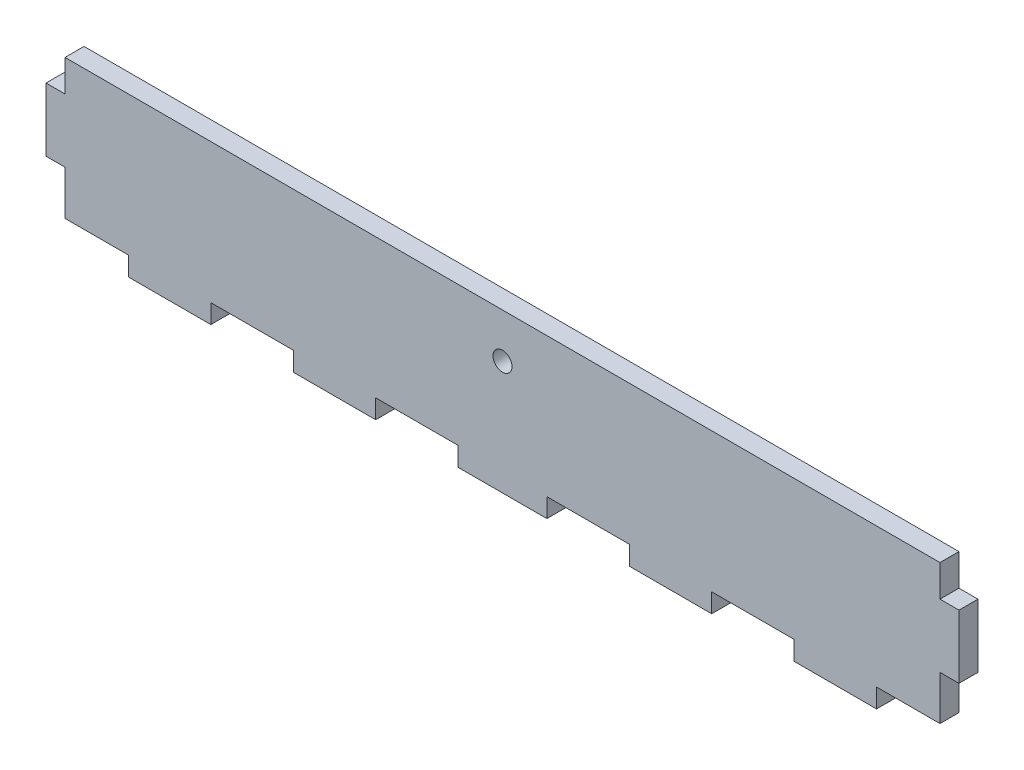
ISO-10303-21;
HEADER;
FILE_DESCRIPTION(('STEP AP214'),'2;1');
FILE_NAME('part.step','',(''),(''),'','','');
FILE_SCHEMA(('AUTOMOTIVE_DESIGN { 1 0 10303 214 1 1 1 1 }'));
ENDSEC;
DATA;
#1=APPLICATION_CONTEXT('core data for automotive mechanical design processes');
#2=APPLICATION_PROTOCOL_DEFINITION('international standard','automotive_design',2000,#1);
#3=PRODUCT_CONTEXT('',#1,'mechanical');
#4=PRODUCT('Part','Part','',(#3));
#5=PRODUCT_RELATED_PRODUCT_CATEGORY('part','',(#4));
#6=PRODUCT_DEFINITION_FORMATION('','',#4);
#7=PRODUCT_DEFINITION_CONTEXT('part definition',#1,'design');
#8=PRODUCT_DEFINITION('design','',#6,#7);
#9=PRODUCT_DEFINITION_SHAPE('','',#8);
#10=(LENGTH_UNIT() NAMED_UNIT(*) SI_UNIT(.MILLI.,.METRE.));
#11=(NAMED_UNIT(*) PLANE_ANGLE_UNIT() SI_UNIT($,.RADIAN.));
#12=(NAMED_UNIT(*) SI_UNIT($,.STERADIAN.) SOLID_ANGLE_UNIT());
#13=UNCERTAINTY_MEASURE_WITH_UNIT(LENGTH_MEASURE(1.E-05),#10,'distance_accuracy_value','');
#14=(GEOMETRIC_REPRESENTATION_CONTEXT(3) GLOBAL_UNCERTAINTY_ASSIGNED_CONTEXT((#13)) GLOBAL_UNIT_ASSIGNED_CONTEXT((#10,
#11,#12)) REPRESENTATION_CONTEXT('',''));
#15=CARTESIAN_POINT('',(0.,0.,0.));
#16=DIRECTION('',(0.,0.,1.));
#17=DIRECTION('',(1.,0.,0.));
#18=AXIS2_PLACEMENT_3D('',#15,#16,#17);
#19=CARTESIAN_POINT('',(0.,0.,3.));
#20=DIRECTION('',(0.,0.,1.));
#21=DIRECTION('',(1.,0.,0.));
#22=AXIS2_PLACEMENT_3D('',#19,#20,#21);
#23=PLANE('',#22);
#24=DIRECTION('',(0.,-1.,0.));
#25=VECTOR('',#24,1.);
#26=CARTESIAN_POINT('',(0.,0.,3.));
#27=LINE('',#26,#25);
#28=CARTESIAN_POINT('',(0.,7.,3.));
#29=VERTEX_POINT('',#28);
#30=CARTESIAN_POINT('',(0.,0.,3.));
#31=VERTEX_POINT('',#30);
#32=EDGE_CURVE('E336',#29,#31,#27,.T.);
#33=ORIENTED_EDGE('',*,*,#32,.T.);
#34=DIRECTION('',(1.,0.,0.));
#35=VECTOR('',#34,1.);
#36=CARTESIAN_POINT('',(0.,0.,3.));
#37=LINE('',#36,#35);
#38=CARTESIAN_POINT('',(10.,0.,3.));
#39=VERTEX_POINT('',#38);
#40=EDGE_CURVE('E164',#31,#39,#37,.T.);
#41=ORIENTED_EDGE('',*,*,#40,.T.);
#42=DIRECTION('',(0.,-1.,0.));
#43=VECTOR('',#42,1.);
#44=CARTESIAN_POINT('',(10.,0.,3.));
#45=LINE('',#44,#43);
#46=CARTESIAN_POINT('',(10.,-3.,3.));
#47=VERTEX_POINT('',#46);
#48=EDGE_CURVE('E423',#39,#47,#45,.T.);
#49=ORIENTED_EDGE('',*,*,#48,.T.);
#50=DIRECTION('',(1.,0.,0.));
#51=VECTOR('',#50,1.);
#52=CARTESIAN_POINT('',(10.,-3.,3.));
#53=LINE('',#52,#51);
#54=CARTESIAN_POINT('',(23.,-3.,3.));
#55=VERTEX_POINT('',#54);
#56=EDGE_CURVE('E442',#47,#55,#53,.T.);
#57=ORIENTED_EDGE('',*,*,#56,.T.);
#58=DIRECTION('',(0.,1.,0.));
#59=VECTOR('',#58,1.);
#60=CARTESIAN_POINT('',(23.,0.,3.));
#61=LINE('',#60,#59);
#62=CARTESIAN_POINT('',(23.,0.,3.));
#63=VERTEX_POINT('',#62);
#64=EDGE_CURVE('E439',#55,#63,#61,.T.);
#65=ORIENTED_EDGE('',*,*,#64,.T.);
#66=DIRECTION('',(1.,0.,0.));
#67=VECTOR('',#66,1.);
#68=CARTESIAN_POINT('',(23.,0.,3.));
#69=LINE('',#68,#67);
#70=CARTESIAN_POINT('',(36.,0.,3.));
#71=VERTEX_POINT('',#70);
#72=EDGE_CURVE('E441',#63,#71,#69,.T.);
#73=ORIENTED_EDGE('',*,*,#72,.T.);
#74=DIRECTION('',(0.,-1.,0.));
#75=VECTOR('',#74,1.);
#76=CARTESIAN_POINT('',(36.,0.,3.));
#77=LINE('',#76,#75);
#78=CARTESIAN_POINT('',(36.,-3.,3.));
#79=VERTEX_POINT('',#78);
#80=EDGE_CURVE('E444',#71,#79,#77,.T.);
#81=ORIENTED_EDGE('',*,*,#80,.T.);
#82=DIRECTION('',(1.,0.,0.));
#83=VECTOR('',#82,1.);
#84=CARTESIAN_POINT('',(36.,-3.,3.));
#85=LINE('',#84,#83);
#86=CARTESIAN_POINT('',(49.,-3.,3.));
#87=VERTEX_POINT('',#86);
#88=EDGE_CURVE('E450',#79,#87,#85,.T.);
#89=ORIENTED_EDGE('',*,*,#88,.T.);
#90=DIRECTION('',(0.,1.,0.));
#91=VECTOR('',#90,1.);
#92=CARTESIAN_POINT('',(49.,0.,3.));
#93=LINE('',#92,#91);
#94=CARTESIAN_POINT('',(49.,0.,3.));
#95=VERTEX_POINT('',#94);
#96=EDGE_CURVE('E452',#87,#95,#93,.T.);
#97=ORIENTED_EDGE('',*,*,#96,.T.);
#98=DIRECTION('',(1.,0.,0.));
#99=VECTOR('',#98,1.);
#100=CARTESIAN_POINT('',(49.,0.,3.));
#101=LINE('',#100,#99);
#102=CARTESIAN_POINT('',(62.,0.,3.));
#103=VERTEX_POINT('',#102);
#104=EDGE_CURVE('E454',#95,#103,#101,.T.);
#105=ORIENTED_EDGE('',*,*,#104,.T.);
#106=DIRECTION('',(0.,-1.,0.));
#107=VECTOR('',#106,1.);
#108=CARTESIAN_POINT('',(62.,0.,3.));
#109=LINE('',#108,#107);
#110=CARTESIAN_POINT('',(62.,-3.,3.));
#111=VERTEX_POINT('',#110);
#112=EDGE_CURVE('E456',#103,#111,#109,.T.);
#113=ORIENTED_EDGE('',*,*,#112,.T.);
#114=DIRECTION('',(1.,0.,0.));
#115=VECTOR('',#114,1.);
#116=CARTESIAN_POINT('',(62.,-3.,3.));
#117=LINE('',#116,#115);
#118=CARTESIAN_POINT('',(76.,-3.,3.));
#119=VERTEX_POINT('',#118);
#120=EDGE_CURVE('E458',#111,#119,#117,.T.);
#121=ORIENTED_EDGE('',*,*,#120,.T.);
#122=DIRECTION('',(0.,1.,0.));
#123=VECTOR('',#122,1.);
#124=CARTESIAN_POINT('',(76.,0.,3.));
#125=LINE('',#124,#123);
#126=CARTESIAN_POINT('',(76.,0.,3.));
#127=VERTEX_POINT('',#126);
#128=EDGE_CURVE('E460',#119,#127,#125,.T.);
#129=ORIENTED_EDGE('',*,*,#128,.T.);
#130=DIRECTION('',(1.,0.,0.));
#131=VECTOR('',#130,1.);
#132=CARTESIAN_POINT('',(76.,0.,3.));
#133=LINE('',#132,#131);
#134=CARTESIAN_POINT('',(89.,0.,3.));
#135=VERTEX_POINT('',#134);
#136=EDGE_CURVE('E462',#127,#135,#133,.T.);
#137=ORIENTED_EDGE('',*,*,#136,.T.);
#138=DIRECTION('',(0.,-1.,0.));
#139=VECTOR('',#138,1.);
#140=CARTESIAN_POINT('',(89.,0.,3.));
#141=LINE('',#140,#139);
#142=CARTESIAN_POINT('',(89.,-3.,3.));
#143=VERTEX_POINT('',#142);
#144=EDGE_CURVE('E464',#135,#143,#141,.T.);
#145=ORIENTED_EDGE('',*,*,#144,.T.);
#146=DIRECTION('',(1.,0.,0.));
#147=VECTOR('',#146,1.);
#148=CARTESIAN_POINT('',(89.,-3.,3.));
#149=LINE('',#148,#147);
#150=CARTESIAN_POINT('',(102.,-3.,3.));
#151=VERTEX_POINT('',#150);
#152=EDGE_CURVE('E466',#143,#151,#149,.T.);
#153=ORIENTED_EDGE('',*,*,#152,.T.);
#154=DIRECTION('',(0.,1.,0.));
#155=VECTOR('',#154,1.);
#156=CARTESIAN_POINT('',(102.,0.,3.));
#157=LINE('',#156,#155);
#158=CARTESIAN_POINT('',(102.,0.,3.));
#159=VERTEX_POINT('',#158);
#160=EDGE_CURVE('E468',#151,#159,#157,.T.);
#161=ORIENTED_EDGE('',*,*,#160,.T.);
#162=DIRECTION('',(1.,0.,0.));
#163=VECTOR('',#162,1.);
#164=CARTESIAN_POINT('',(102.,0.,3.));
#165=LINE('',#164,#163);
#166=CARTESIAN_POINT('',(115.,0.,3.));
#167=VERTEX_POINT('',#166);
#168=EDGE_CURVE('E470',#159,#167,#165,.T.);
#169=ORIENTED_EDGE('',*,*,#168,.T.);
#170=DIRECTION('',(0.,-1.,0.));
#171=VECTOR('',#170,1.);
#172=CARTESIAN_POINT('',(115.,0.,3.));
#173=LINE('',#172,#171);
#174=CARTESIAN_POINT('',(115.,-3.,3.));
#175=VERTEX_POINT('',#174);
#176=EDGE_CURVE('E472',#167,#175,#173,.T.);
#177=ORIENTED_EDGE('',*,*,#176,.T.);
#178=DIRECTION('',(1.,0.,0.));
#179=VECTOR('',#178,1.);
#180=CARTESIAN_POINT('',(115.,-3.,3.));
#181=LINE('',#180,#179);
#182=CARTESIAN_POINT('',(128.,-3.,3.));
#183=VERTEX_POINT('',#182);
#184=EDGE_CURVE('E474',#175,#183,#181,.T.);
#185=ORIENTED_EDGE('',*,*,#184,.T.);
#186=DIRECTION('',(0.,1.,0.));
#187=VECTOR('',#186,1.);
#188=CARTESIAN_POINT('',(128.,0.,3.));
#189=LINE('',#188,#187);
#190=CARTESIAN_POINT('',(128.,0.,3.));
#191=VERTEX_POINT('',#190);
#192=EDGE_CURVE('E476',#183,#191,#189,.T.);
#193=ORIENTED_EDGE('',*,*,#192,.T.);
#194=DIRECTION('',(1.,0.,0.));
#195=VECTOR('',#194,1.);
#196=CARTESIAN_POINT('',(128.,0.,3.));
#197=LINE('',#196,#195);
#198=CARTESIAN_POINT('',(138.,0.,3.));
#199=VERTEX_POINT('',#198);
#200=EDGE_CURVE('E478',#191,#199,#197,.T.);
#201=ORIENTED_EDGE('',*,*,#200,.T.);
#202=DIRECTION('',(0.,1.,0.));
#203=VECTOR('',#202,1.);
#204=CARTESIAN_POINT('',(138.,0.,3.));
#205=LINE('',#204,#203);
#206=CARTESIAN_POINT('',(138.,7.00000000000002,3.));
#207=VERTEX_POINT('',#206);
#208=EDGE_CURVE('E480',#199,#207,#205,.T.);
#209=ORIENTED_EDGE('',*,*,#208,.T.);
#210=DIRECTION('',(1.,0.,0.));
#211=VECTOR('',#210,1.);
#212=CARTESIAN_POINT('',(138.,7.00000000000002,3.));
#213=LINE('',#212,#211);
#214=CARTESIAN_POINT('',(141.,7.00000000000002,3.));
#215=VERTEX_POINT('',#214);
#216=EDGE_CURVE('E482',#207,#215,#213,.T.);
#217=ORIENTED_EDGE('',*,*,#216,.T.);
#218=DIRECTION('',(0.,1.,0.));
#219=VECTOR('',#218,1.);
#220=CARTESIAN_POINT('',(141.,17.,3.));
#221=LINE('',#220,#219);
#222=CARTESIAN_POINT('',(141.,17.,3.));
#223=VERTEX_POINT('',#222);
#224=EDGE_CURVE('E484',#215,#223,#221,.T.);
#225=ORIENTED_EDGE('',*,*,#224,.T.);
#226=DIRECTION('',(-1.,0.,0.));
#227=VECTOR('',#226,1.);
#228=CARTESIAN_POINT('',(138.,17.,3.));
#229=LINE('',#228,#227);
#230=CARTESIAN_POINT('',(138.,17.,3.));
#231=VERTEX_POINT('',#230);
#232=EDGE_CURVE('E486',#223,#231,#229,.T.);
#233=ORIENTED_EDGE('',*,*,#232,.T.);
#234=DIRECTION('',(0.,1.,0.));
#235=VECTOR('',#234,1.);
#236=CARTESIAN_POINT('',(138.,17.,3.));
#237=LINE('',#236,#235);
#238=CARTESIAN_POINT('',(138.,22.,3.));
#239=VERTEX_POINT('',#238);
#240=EDGE_CURVE('E488',#231,#239,#237,.T.);
#241=ORIENTED_EDGE('',*,*,#240,.T.);
#242=DIRECTION('',(-1.,0.,0.));
#243=VECTOR('',#242,1.);
#244=CARTESIAN_POINT('',(0.,22.,3.));
#245=LINE('',#244,#243);
#246=CARTESIAN_POINT('',(0.,22.,3.));
#247=VERTEX_POINT('',#246);
#248=EDGE_CURVE('E490',#239,#247,#245,.T.);
#249=ORIENTED_EDGE('',*,*,#248,.T.);
#250=DIRECTION('',(0.,-1.,0.));
#251=VECTOR('',#250,1.);
#252=CARTESIAN_POINT('',(0.,17.,3.));
#253=LINE('',#252,#251);
#254=CARTESIAN_POINT('',(0.,17.,3.));
#255=VERTEX_POINT('',#254);
#256=EDGE_CURVE('E255',#247,#255,#253,.T.);
#257=ORIENTED_EDGE('',*,*,#256,.T.);
#258=DIRECTION('',(-1.,0.,0.));
#259=VECTOR('',#258,1.);
#260=CARTESIAN_POINT('',(0.,17.,3.));
#261=LINE('',#260,#259);
#262=CARTESIAN_POINT('',(-3.,17.,3.));
#263=VERTEX_POINT('',#262);
#264=EDGE_CURVE('E249',#255,#263,#261,.T.);
#265=ORIENTED_EDGE('',*,*,#264,.T.);
#266=DIRECTION('',(0.,-1.,0.));
#267=VECTOR('',#266,1.);
#268=CARTESIAN_POINT('',(-3.,17.,3.));
#269=LINE('',#268,#267);
#270=CARTESIAN_POINT('',(-3.,7.,3.));
#271=VERTEX_POINT('',#270);
#272=EDGE_CURVE('E253',#263,#271,#269,.T.);
#273=ORIENTED_EDGE('',*,*,#272,.T.);
#274=DIRECTION('',(1.,0.,0.));
#275=VECTOR('',#274,1.);
#276=CARTESIAN_POINT('',(0.,7.,3.));
#277=LINE('',#276,#275);
#278=EDGE_CURVE('E49',#271,#29,#277,.T.);
#279=ORIENTED_EDGE('',*,*,#278,.T.);
#280=EDGE_LOOP('',(#33,#41,#49,#57,#65,#73,#81,#89,#97,#105,#113,#121,#129,#137,#145,#153,#161,
#169,#177,#185,#193,#201,#209,#217,#225,#233,#241,#249,#257,#265,#273,#279));
#281=FACE_BOUND('',#280,.T.);
#282=CARTESIAN_POINT('',(69.,15.,3.));
#283=DIRECTION('',(0.,0.,1.));
#284=DIRECTION('',(1.,0.,0.));
#285=AXIS2_PLACEMENT_3D('',#282,#283,#284);
#286=CIRCLE('',#285,1.5);
#287=CARTESIAN_POINT('',(70.5,15.,3.));
#288=VERTEX_POINT('',#287);
#289=EDGE_CURVE('E277',#288,#288,#286,.T.);
#290=ORIENTED_EDGE('',*,*,#289,.F.);
#291=EDGE_LOOP('',(#290));
#292=FACE_BOUND('',#291,.T.);
#293=ADVANCED_FACE('F32',(#281,#292),#23,.T.);
#294=CARTESIAN_POINT('',(0.,0.,0.));
#295=DIRECTION('',(0.,0.,1.));
#296=DIRECTION('',(1.,0.,0.));
#297=AXIS2_PLACEMENT_3D('',#294,#295,#296);
#298=PLANE('',#297);
#299=DIRECTION('',(0.,-1.,0.));
#300=VECTOR('',#299,1.);
#301=CARTESIAN_POINT('',(0.,0.,0.));
#302=LINE('',#301,#300);
#303=CARTESIAN_POINT('',(0.,7.,0.));
#304=VERTEX_POINT('',#303);
#305=CARTESIAN_POINT('',(0.,0.,0.));
#306=VERTEX_POINT('',#305);
#307=EDGE_CURVE('E273',#304,#306,#302,.T.);
#308=ORIENTED_EDGE('',*,*,#307,.F.);
#309=DIRECTION('',(1.,0.,0.));
#310=VECTOR('',#309,1.);
#311=CARTESIAN_POINT('',(0.,7.,0.));
#312=LINE('',#311,#310);
#313=CARTESIAN_POINT('',(-3.,7.,0.));
#314=VERTEX_POINT('',#313);
#315=EDGE_CURVE('E156',#314,#304,#312,.T.);
#316=ORIENTED_EDGE('',*,*,#315,.F.);
#317=DIRECTION('',(0.,-1.,0.));
#318=VECTOR('',#317,1.);
#319=CARTESIAN_POINT('',(-3.,17.,0.));
#320=LINE('',#319,#318);
#321=CARTESIAN_POINT('',(-3.,17.,0.));
#322=VERTEX_POINT('',#321);
#323=EDGE_CURVE('E150',#322,#314,#320,.T.);
#324=ORIENTED_EDGE('',*,*,#323,.F.);
#325=DIRECTION('',(-1.,0.,0.));
#326=VECTOR('',#325,1.);
#327=CARTESIAN_POINT('',(0.,17.,0.));
#328=LINE('',#327,#326);
#329=CARTESIAN_POINT('',(0.,17.,0.));
#330=VERTEX_POINT('',#329);
#331=EDGE_CURVE('E263',#330,#322,#328,.T.);
#332=ORIENTED_EDGE('',*,*,#331,.F.);
#333=DIRECTION('',(0.,-1.,0.));
#334=VECTOR('',#333,1.);
#335=CARTESIAN_POINT('',(0.,17.,0.));
#336=LINE('',#335,#334);
#337=CARTESIAN_POINT('',(0.,22.,0.));
#338=VERTEX_POINT('',#337);
#339=EDGE_CURVE('E331',#338,#330,#336,.T.);
#340=ORIENTED_EDGE('',*,*,#339,.F.);
#341=DIRECTION('',(-1.,0.,0.));
#342=VECTOR('',#341,1.);
#343=CARTESIAN_POINT('',(0.,22.,0.));
#344=LINE('',#343,#342);
#345=CARTESIAN_POINT('',(138.,22.,0.));
#346=VERTEX_POINT('',#345);
#347=EDGE_CURVE('E329',#346,#338,#344,.T.);
#348=ORIENTED_EDGE('',*,*,#347,.F.);
#349=DIRECTION('',(0.,1.,0.));
#350=VECTOR('',#349,1.);
#351=CARTESIAN_POINT('',(138.,17.,0.));
#352=LINE('',#351,#350);
#353=CARTESIAN_POINT('',(138.,17.,0.));
#354=VERTEX_POINT('',#353);
#355=EDGE_CURVE('E327',#354,#346,#352,.T.);
#356=ORIENTED_EDGE('',*,*,#355,.F.);
#357=DIRECTION('',(-1.,0.,0.));
#358=VECTOR('',#357,1.);
#359=CARTESIAN_POINT('',(138.,17.,0.));
#360=LINE('',#359,#358);
#361=CARTESIAN_POINT('',(141.,17.,0.));
#362=VERTEX_POINT('',#361);
#363=EDGE_CURVE('E325',#362,#354,#360,.T.);
#364=ORIENTED_EDGE('',*,*,#363,.F.);
#365=DIRECTION('',(0.,1.,0.));
#366=VECTOR('',#365,1.);
#367=CARTESIAN_POINT('',(141.,17.,0.));
#368=LINE('',#367,#366);
#369=CARTESIAN_POINT('',(141.,7.00000000000002,0.));
#370=VERTEX_POINT('',#369);
#371=EDGE_CURVE('E323',#370,#362,#368,.T.);
#372=ORIENTED_EDGE('',*,*,#371,.F.);
#373=DIRECTION('',(1.,0.,0.));
#374=VECTOR('',#373,1.);
#375=CARTESIAN_POINT('',(138.,7.00000000000002,0.));
#376=LINE('',#375,#374);
#377=CARTESIAN_POINT('',(138.,7.00000000000002,0.));
#378=VERTEX_POINT('',#377);
#379=EDGE_CURVE('E321',#378,#370,#376,.T.);
#380=ORIENTED_EDGE('',*,*,#379,.F.);
#381=DIRECTION('',(0.,1.,0.));
#382=VECTOR('',#381,1.);
#383=CARTESIAN_POINT('',(138.,0.,0.));
#384=LINE('',#383,#382);
#385=CARTESIAN_POINT('',(138.,0.,0.));
#386=VERTEX_POINT('',#385);
#387=EDGE_CURVE('E319',#386,#378,#384,.T.);
#388=ORIENTED_EDGE('',*,*,#387,.F.);
#389=DIRECTION('',(1.,0.,0.));
#390=VECTOR('',#389,1.);
#391=CARTESIAN_POINT('',(128.,0.,0.));
#392=LINE('',#391,#390);
#393=CARTESIAN_POINT('',(128.,0.,0.));
#394=VERTEX_POINT('',#393);
#395=EDGE_CURVE('E317',#394,#386,#392,.T.);
#396=ORIENTED_EDGE('',*,*,#395,.F.);
#397=DIRECTION('',(0.,1.,0.));
#398=VECTOR('',#397,1.);
#399=CARTESIAN_POINT('',(128.,0.,0.));
#400=LINE('',#399,#398);
#401=CARTESIAN_POINT('',(128.,-3.,0.));
#402=VERTEX_POINT('',#401);
#403=EDGE_CURVE('E315',#402,#394,#400,.T.);
#404=ORIENTED_EDGE('',*,*,#403,.F.);
#405=DIRECTION('',(1.,0.,0.));
#406=VECTOR('',#405,1.);
#407=CARTESIAN_POINT('',(115.,-3.,0.));
#408=LINE('',#407,#406);
#409=CARTESIAN_POINT('',(115.,-3.,0.));
#410=VERTEX_POINT('',#409);
#411=EDGE_CURVE('E313',#410,#402,#408,.T.);
#412=ORIENTED_EDGE('',*,*,#411,.F.);
#413=DIRECTION('',(0.,-1.,0.));
#414=VECTOR('',#413,1.);
#415=CARTESIAN_POINT('',(115.,0.,0.));
#416=LINE('',#415,#414);
#417=CARTESIAN_POINT('',(115.,0.,0.));
#418=VERTEX_POINT('',#417);
#419=EDGE_CURVE('E311',#418,#410,#416,.T.);
#420=ORIENTED_EDGE('',*,*,#419,.F.);
#421=DIRECTION('',(1.,0.,0.));
#422=VECTOR('',#421,1.);
#423=CARTESIAN_POINT('',(102.,0.,0.));
#424=LINE('',#423,#422);
#425=CARTESIAN_POINT('',(102.,0.,0.));
#426=VERTEX_POINT('',#425);
#427=EDGE_CURVE('E309',#426,#418,#424,.T.);
#428=ORIENTED_EDGE('',*,*,#427,.F.);
#429=DIRECTION('',(0.,1.,0.));
#430=VECTOR('',#429,1.);
#431=CARTESIAN_POINT('',(102.,0.,0.));
#432=LINE('',#431,#430);
#433=CARTESIAN_POINT('',(102.,-3.,0.));
#434=VERTEX_POINT('',#433);
#435=EDGE_CURVE('E307',#434,#426,#432,.T.);
#436=ORIENTED_EDGE('',*,*,#435,.F.);
#437=DIRECTION('',(1.,0.,0.));
#438=VECTOR('',#437,1.);
#439=CARTESIAN_POINT('',(89.,-3.,0.));
#440=LINE('',#439,#438);
#441=CARTESIAN_POINT('',(89.,-3.,0.));
#442=VERTEX_POINT('',#441);
#443=EDGE_CURVE('E305',#442,#434,#440,.T.);
#444=ORIENTED_EDGE('',*,*,#443,.F.);
#445=DIRECTION('',(0.,-1.,0.));
#446=VECTOR('',#445,1.);
#447=CARTESIAN_POINT('',(89.,0.,0.));
#448=LINE('',#447,#446);
#449=CARTESIAN_POINT('',(89.,0.,0.));
#450=VERTEX_POINT('',#449);
#451=EDGE_CURVE('E303',#450,#442,#448,.T.);
#452=ORIENTED_EDGE('',*,*,#451,.F.);
#453=DIRECTION('',(1.,0.,0.));
#454=VECTOR('',#453,1.);
#455=CARTESIAN_POINT('',(76.,0.,0.));
#456=LINE('',#455,#454);
#457=CARTESIAN_POINT('',(76.,0.,0.));
#458=VERTEX_POINT('',#457);
#459=EDGE_CURVE('E301',#458,#450,#456,.T.);
#460=ORIENTED_EDGE('',*,*,#459,.F.);
#461=DIRECTION('',(0.,1.,0.));
#462=VECTOR('',#461,1.);
#463=CARTESIAN_POINT('',(76.,0.,0.));
#464=LINE('',#463,#462);
#465=CARTESIAN_POINT('',(76.,-3.,0.));
#466=VERTEX_POINT('',#465);
#467=EDGE_CURVE('E299',#466,#458,#464,.T.);
#468=ORIENTED_EDGE('',*,*,#467,.F.);
#469=DIRECTION('',(1.,0.,0.));
#470=VECTOR('',#469,1.);
#471=CARTESIAN_POINT('',(62.,-3.,0.));
#472=LINE('',#471,#470);
#473=CARTESIAN_POINT('',(62.,-3.,0.));
#474=VERTEX_POINT('',#473);
#475=EDGE_CURVE('E297',#474,#466,#472,.T.);
#476=ORIENTED_EDGE('',*,*,#475,.F.);
#477=DIRECTION('',(0.,-1.,0.));
#478=VECTOR('',#477,1.);
#479=CARTESIAN_POINT('',(62.,0.,0.));
#480=LINE('',#479,#478);
#481=CARTESIAN_POINT('',(62.,0.,0.));
#482=VERTEX_POINT('',#481);
#483=EDGE_CURVE('E295',#482,#474,#480,.T.);
#484=ORIENTED_EDGE('',*,*,#483,.F.);
#485=DIRECTION('',(1.,0.,0.));
#486=VECTOR('',#485,1.);
#487=CARTESIAN_POINT('',(49.,0.,0.));
#488=LINE('',#487,#486);
#489=CARTESIAN_POINT('',(49.,0.,0.));
#490=VERTEX_POINT('',#489);
#491=EDGE_CURVE('E293',#490,#482,#488,.T.);
#492=ORIENTED_EDGE('',*,*,#491,.F.);
#493=DIRECTION('',(0.,1.,0.));
#494=VECTOR('',#493,1.);
#495=CARTESIAN_POINT('',(49.,0.,0.));
#496=LINE('',#495,#494);
#497=CARTESIAN_POINT('',(49.,-3.,0.));
#498=VERTEX_POINT('',#497);
#499=EDGE_CURVE('E291',#498,#490,#496,.T.);
#500=ORIENTED_EDGE('',*,*,#499,.F.);
#501=DIRECTION('',(1.,0.,0.));
#502=VECTOR('',#501,1.);
#503=CARTESIAN_POINT('',(36.,-3.,0.));
#504=LINE('',#503,#502);
#505=CARTESIAN_POINT('',(36.,-3.,0.));
#506=VERTEX_POINT('',#505);
#507=EDGE_CURVE('E289',#506,#498,#504,.T.);
#508=ORIENTED_EDGE('',*,*,#507,.F.);
#509=DIRECTION('',(0.,-1.,0.));
#510=VECTOR('',#509,1.);
#511=CARTESIAN_POINT('',(36.,0.,0.));
#512=LINE('',#511,#510);
#513=CARTESIAN_POINT('',(36.,0.,0.));
#514=VERTEX_POINT('',#513);
#515=EDGE_CURVE('E287',#514,#506,#512,.T.);
#516=ORIENTED_EDGE('',*,*,#515,.F.);
#517=DIRECTION('',(1.,0.,0.));
#518=VECTOR('',#517,1.);
#519=CARTESIAN_POINT('',(23.,0.,0.));
#520=LINE('',#519,#518);
#521=CARTESIAN_POINT('',(23.,0.,0.));
#522=VERTEX_POINT('',#521);
#523=EDGE_CURVE('E285',#522,#514,#520,.T.);
#524=ORIENTED_EDGE('',*,*,#523,.F.);
#525=DIRECTION('',(0.,1.,0.));
#526=VECTOR('',#525,1.);
#527=CARTESIAN_POINT('',(23.,0.,0.));
#528=LINE('',#527,#526);
#529=CARTESIAN_POINT('',(23.,-3.,0.));
#530=VERTEX_POINT('',#529);
#531=EDGE_CURVE('E283',#530,#522,#528,.T.);
#532=ORIENTED_EDGE('',*,*,#531,.F.);
#533=DIRECTION('',(1.,0.,0.));
#534=VECTOR('',#533,1.);
#535=CARTESIAN_POINT('',(10.,-3.,0.));
#536=LINE('',#535,#534);
#537=CARTESIAN_POINT('',(10.,-3.,0.));
#538=VERTEX_POINT('',#537);
#539=EDGE_CURVE('E281',#538,#530,#536,.T.);
#540=ORIENTED_EDGE('',*,*,#539,.F.);
#541=DIRECTION('',(0.,-1.,0.));
#542=VECTOR('',#541,1.);
#543=CARTESIAN_POINT('',(10.,0.,0.));
#544=LINE('',#543,#542);
#545=CARTESIAN_POINT('',(10.,0.,0.));
#546=VERTEX_POINT('',#545);
#547=EDGE_CURVE('E279',#546,#538,#544,.T.);
#548=ORIENTED_EDGE('',*,*,#547,.F.);
#549=DIRECTION('',(1.,0.,0.));
#550=VECTOR('',#549,1.);
#551=CARTESIAN_POINT('',(0.,0.,0.));
#552=LINE('',#551,#550);
#553=EDGE_CURVE('E276',#306,#546,#552,.T.);
#554=ORIENTED_EDGE('',*,*,#553,.F.);
#555=EDGE_LOOP('',(#308,#316,#324,#332,#340,#348,#356,#364,#372,#380,#388,#396,#404,#412,#420,
#428,#436,#444,#452,#460,#468,#476,#484,#492,#500,#508,#516,#524,#532,#540,#548,#554));
#556=FACE_BOUND('',#555,.T.);
#557=CARTESIAN_POINT('',(69.,15.,0.));
#558=DIRECTION('',(0.,0.,1.));
#559=DIRECTION('',(1.,0.,0.));
#560=AXIS2_PLACEMENT_3D('',#557,#558,#559);
#561=CIRCLE('',#560,1.5);
#562=CARTESIAN_POINT('',(70.5,15.,0.));
#563=VERTEX_POINT('',#562);
#564=EDGE_CURVE('E897',#563,#563,#561,.T.);
#565=ORIENTED_EDGE('',*,*,#564,.T.);
#566=EDGE_LOOP('',(#565));
#567=FACE_BOUND('',#566,.T.);
#568=ADVANCED_FACE('F427',(#556,#567),#298,.F.);
#569=CARTESIAN_POINT('',(0.,0.,3.));
#570=DIRECTION('',(1.,0.,0.));
#571=DIRECTION('',(0.,0.,-1.));
#572=AXIS2_PLACEMENT_3D('',#569,#570,#571);
#573=PLANE('',#572);
#574=ORIENTED_EDGE('',*,*,#307,.T.);
#575=DIRECTION('',(0.,0.,-1.));
#576=VECTOR('',#575,1.);
#577=CARTESIAN_POINT('',(0.,0.,3.));
#578=LINE('',#577,#576);
#579=EDGE_CURVE('E11',#31,#306,#578,.T.);
#580=ORIENTED_EDGE('',*,*,#579,.F.);
#581=ORIENTED_EDGE('',*,*,#32,.F.);
#582=DIRECTION('',(0.,0.,-1.));
#583=VECTOR('',#582,1.);
#584=CARTESIAN_POINT('',(0.,7.,3.));
#585=LINE('',#584,#583);
#586=EDGE_CURVE('E269',#29,#304,#585,.T.);
#587=ORIENTED_EDGE('',*,*,#586,.T.);
#588=EDGE_LOOP('',(#574,#580,#581,#587));
#589=FACE_BOUND('',#588,.T.);
#590=ADVANCED_FACE('F34',(#589),#573,.F.);
#591=CARTESIAN_POINT('',(0.,0.,3.));
#592=DIRECTION('',(0.,1.,0.));
#593=DIRECTION('',(0.,0.,1.));
#594=AXIS2_PLACEMENT_3D('',#591,#592,#593);
#595=PLANE('',#594);
#596=ORIENTED_EDGE('',*,*,#553,.T.);
#597=DIRECTION('',(0.,0.,-1.));
#598=VECTOR('',#597,1.);
#599=CARTESIAN_POINT('',(10.,0.,3.));
#600=LINE('',#599,#598);
#601=EDGE_CURVE('E41',#39,#546,#600,.T.);
#602=ORIENTED_EDGE('',*,*,#601,.F.);
#603=ORIENTED_EDGE('',*,*,#40,.F.);
#604=ORIENTED_EDGE('',*,*,#579,.T.);
#605=EDGE_LOOP('',(#596,#602,#603,#604));
#606=FACE_BOUND('',#605,.T.);
#607=ADVANCED_FACE('F524',(#606),#595,.F.);
#608=CARTESIAN_POINT('',(10.,0.,3.));
#609=DIRECTION('',(1.,0.,0.));
#610=DIRECTION('',(0.,0.,-1.));
#611=AXIS2_PLACEMENT_3D('',#608,#609,#610);
#612=PLANE('',#611);
#613=ORIENTED_EDGE('',*,*,#547,.T.);
#614=DIRECTION('',(0.,0.,-1.));
#615=VECTOR('',#614,1.);
#616=CARTESIAN_POINT('',(10.,-3.,3.));
#617=LINE('',#616,#615);
#618=EDGE_CURVE('E415',#47,#538,#617,.T.);
#619=ORIENTED_EDGE('',*,*,#618,.F.);
#620=ORIENTED_EDGE('',*,*,#48,.F.);
#621=ORIENTED_EDGE('',*,*,#601,.T.);
#622=EDGE_LOOP('',(#613,#619,#620,#621));
#623=FACE_BOUND('',#622,.T.);
#624=ADVANCED_FACE('F421',(#623),#612,.F.);
#625=CARTESIAN_POINT('',(10.,-3.,3.));
#626=DIRECTION('',(0.,1.,0.));
#627=DIRECTION('',(0.,0.,1.));
#628=AXIS2_PLACEMENT_3D('',#625,#626,#627);
#629=PLANE('',#628);
#630=ORIENTED_EDGE('',*,*,#539,.T.);
#631=DIRECTION('',(0.,0.,-1.));
#632=VECTOR('',#631,1.);
#633=CARTESIAN_POINT('',(23.,-3.,3.));
#634=LINE('',#633,#632);
#635=EDGE_CURVE('E412',#55,#530,#634,.T.);
#636=ORIENTED_EDGE('',*,*,#635,.F.);
#637=ORIENTED_EDGE('',*,*,#56,.F.);
#638=ORIENTED_EDGE('',*,*,#618,.T.);
#639=EDGE_LOOP('',(#630,#636,#637,#638));
#640=FACE_BOUND('',#639,.T.);
#641=ADVANCED_FACE('F433',(#640),#629,.F.);
#642=CARTESIAN_POINT('',(23.,0.,3.));
#643=DIRECTION('',(-1.,0.,0.));
#644=DIRECTION('',(0.,0.,1.));
#645=AXIS2_PLACEMENT_3D('',#642,#643,#644);
#646=PLANE('',#645);
#647=ORIENTED_EDGE('',*,*,#531,.T.);
#648=DIRECTION('',(0.,0.,-1.));
#649=VECTOR('',#648,1.);
#650=CARTESIAN_POINT('',(23.,0.,3.));
#651=LINE('',#650,#649);
#652=EDGE_CURVE('E409',#63,#522,#651,.T.);
#653=ORIENTED_EDGE('',*,*,#652,.F.);
#654=ORIENTED_EDGE('',*,*,#64,.F.);
#655=ORIENTED_EDGE('',*,*,#635,.T.);
#656=EDGE_LOOP('',(#647,#653,#654,#655));
#657=FACE_BOUND('',#656,.T.);
#658=ADVANCED_FACE('F437',(#657),#646,.F.);
#659=CARTESIAN_POINT('',(23.,0.,3.));
#660=DIRECTION('',(0.,1.,0.));
#661=DIRECTION('',(0.,0.,1.));
#662=AXIS2_PLACEMENT_3D('',#659,#660,#661);
#663=PLANE('',#662);
#664=ORIENTED_EDGE('',*,*,#523,.T.);
#665=DIRECTION('',(0.,0.,-1.));
#666=VECTOR('',#665,1.);
#667=CARTESIAN_POINT('',(36.,0.,3.));
#668=LINE('',#667,#666);
#669=EDGE_CURVE('E406',#71,#514,#668,.T.);
#670=ORIENTED_EDGE('',*,*,#669,.F.);
#671=ORIENTED_EDGE('',*,*,#72,.F.);
#672=ORIENTED_EDGE('',*,*,#652,.T.);
#673=EDGE_LOOP('',(#664,#670,#671,#672));
#674=FACE_BOUND('',#673,.T.);
#675=ADVANCED_FACE('F537',(#674),#663,.F.);
#676=CARTESIAN_POINT('',(36.,0.,3.));
#677=DIRECTION('',(1.,0.,0.));
#678=DIRECTION('',(0.,0.,-1.));
#679=AXIS2_PLACEMENT_3D('',#676,#677,#678);
#680=PLANE('',#679);
#681=ORIENTED_EDGE('',*,*,#515,.T.);
#682=DIRECTION('',(0.,0.,-1.));
#683=VECTOR('',#682,1.);
#684=CARTESIAN_POINT('',(36.,-3.,3.));
#685=LINE('',#684,#683);
#686=EDGE_CURVE('E403',#79,#506,#685,.T.);
#687=ORIENTED_EDGE('',*,*,#686,.F.);
#688=ORIENTED_EDGE('',*,*,#80,.F.);
#689=ORIENTED_EDGE('',*,*,#669,.T.);
#690=EDGE_LOOP('',(#681,#687,#688,#689));
#691=FACE_BOUND('',#690,.T.);
#692=ADVANCED_FACE('F540',(#691),#680,.F.);
#693=CARTESIAN_POINT('',(36.,-3.,3.));
#694=DIRECTION('',(0.,1.,0.));
#695=DIRECTION('',(0.,0.,1.));
#696=AXIS2_PLACEMENT_3D('',#693,#694,#695);
#697=PLANE('',#696);
#698=ORIENTED_EDGE('',*,*,#507,.T.);
#699=DIRECTION('',(0.,0.,-1.));
#700=VECTOR('',#699,1.);
#701=CARTESIAN_POINT('',(49.,-3.,3.));
#702=LINE('',#701,#700);
#703=EDGE_CURVE('E400',#87,#498,#702,.T.);
#704=ORIENTED_EDGE('',*,*,#703,.F.);
#705=ORIENTED_EDGE('',*,*,#88,.F.);
#706=ORIENTED_EDGE('',*,*,#686,.T.);
#707=EDGE_LOOP('',(#698,#704,#705,#706));
#708=FACE_BOUND('',#707,.T.);
#709=ADVANCED_FACE('F544',(#708),#697,.F.);
#710=CARTESIAN_POINT('',(49.,0.,3.));
#711=DIRECTION('',(-1.,0.,0.));
#712=DIRECTION('',(0.,0.,1.));
#713=AXIS2_PLACEMENT_3D('',#710,#711,#712);
#714=PLANE('',#713);
#715=ORIENTED_EDGE('',*,*,#499,.T.);
#716=DIRECTION('',(0.,0.,-1.));
#717=VECTOR('',#716,1.);
#718=CARTESIAN_POINT('',(49.,0.,3.));
#719=LINE('',#718,#717);
#720=EDGE_CURVE('E397',#95,#490,#719,.T.);
#721=ORIENTED_EDGE('',*,*,#720,.F.);
#722=ORIENTED_EDGE('',*,*,#96,.F.);
#723=ORIENTED_EDGE('',*,*,#703,.T.);
#724=EDGE_LOOP('',(#715,#721,#722,#723));
#725=FACE_BOUND('',#724,.T.);
#726=ADVANCED_FACE('F548',(#725),#714,.F.);
#727=CARTESIAN_POINT('',(49.,0.,3.));
#728=DIRECTION('',(0.,1.,0.));
#729=DIRECTION('',(0.,0.,1.));
#730=AXIS2_PLACEMENT_3D('',#727,#728,#729);
#731=PLANE('',#730);
#732=ORIENTED_EDGE('',*,*,#491,.T.);
#733=DIRECTION('',(0.,0.,-1.));
#734=VECTOR('',#733,1.);
#735=CARTESIAN_POINT('',(62.,0.,3.));
#736=LINE('',#735,#734);
#737=EDGE_CURVE('E394',#103,#482,#736,.T.);
#738=ORIENTED_EDGE('',*,*,#737,.F.);
#739=ORIENTED_EDGE('',*,*,#104,.F.);
#740=ORIENTED_EDGE('',*,*,#720,.T.);
#741=EDGE_LOOP('',(#732,#738,#739,#740));
#742=FACE_BOUND('',#741,.T.);
#743=ADVANCED_FACE('F552',(#742),#731,.F.);
#744=CARTESIAN_POINT('',(62.,0.,3.));
#745=DIRECTION('',(1.,0.,0.));
#746=DIRECTION('',(0.,0.,-1.));
#747=AXIS2_PLACEMENT_3D('',#744,#745,#746);
#748=PLANE('',#747);
#749=ORIENTED_EDGE('',*,*,#483,.T.);
#750=DIRECTION('',(0.,0.,-1.));
#751=VECTOR('',#750,1.);
#752=CARTESIAN_POINT('',(62.,-3.,3.));
#753=LINE('',#752,#751);
#754=EDGE_CURVE('E391',#111,#474,#753,.T.);
#755=ORIENTED_EDGE('',*,*,#754,.F.);
#756=ORIENTED_EDGE('',*,*,#112,.F.);
#757=ORIENTED_EDGE('',*,*,#737,.T.);
#758=EDGE_LOOP('',(#749,#755,#756,#757));
#759=FACE_BOUND('',#758,.T.);
#760=ADVANCED_FACE('F556',(#759),#748,.F.);
#761=CARTESIAN_POINT('',(62.,-3.,3.));
#762=DIRECTION('',(0.,1.,0.));
#763=DIRECTION('',(0.,0.,1.));
#764=AXIS2_PLACEMENT_3D('',#761,#762,#763);
#765=PLANE('',#764);
#766=ORIENTED_EDGE('',*,*,#475,.T.);
#767=DIRECTION('',(0.,0.,-1.));
#768=VECTOR('',#767,1.);
#769=CARTESIAN_POINT('',(76.,-3.,3.));
#770=LINE('',#769,#768);
#771=EDGE_CURVE('E388',#119,#466,#770,.T.);
#772=ORIENTED_EDGE('',*,*,#771,.F.);
#773=ORIENTED_EDGE('',*,*,#120,.F.);
#774=ORIENTED_EDGE('',*,*,#754,.T.);
#775=EDGE_LOOP('',(#766,#772,#773,#774));
#776=FACE_BOUND('',#775,.T.);
#777=ADVANCED_FACE('F560',(#776),#765,.F.);
#778=CARTESIAN_POINT('',(76.,0.,3.));
#779=DIRECTION('',(-1.,0.,0.));
#780=DIRECTION('',(0.,-1.,0.));
#781=AXIS2_PLACEMENT_3D('',#778,#779,#780);
#782=PLANE('',#781);
#783=ORIENTED_EDGE('',*,*,#467,.T.);
#784=DIRECTION('',(0.,0.,-1.));
#785=VECTOR('',#784,1.);
#786=CARTESIAN_POINT('',(76.,0.,3.));
#787=LINE('',#786,#785);
#788=EDGE_CURVE('E385',#127,#458,#787,.T.);
#789=ORIENTED_EDGE('',*,*,#788,.F.);
#790=ORIENTED_EDGE('',*,*,#128,.F.);
#791=ORIENTED_EDGE('',*,*,#771,.T.);
#792=EDGE_LOOP('',(#783,#789,#790,#791));
#793=FACE_BOUND('',#792,.T.);
#794=ADVANCED_FACE('F564',(#793),#782,.F.);
#795=CARTESIAN_POINT('',(76.,0.,3.));
#796=DIRECTION('',(0.,1.,0.));
#797=DIRECTION('',(0.,0.,1.));
#798=AXIS2_PLACEMENT_3D('',#795,#796,#797);
#799=PLANE('',#798);
#800=ORIENTED_EDGE('',*,*,#459,.T.);
#801=DIRECTION('',(0.,0.,-1.));
#802=VECTOR('',#801,1.);
#803=CARTESIAN_POINT('',(89.,0.,3.));
#804=LINE('',#803,#802);
#805=EDGE_CURVE('E382',#135,#450,#804,.T.);
#806=ORIENTED_EDGE('',*,*,#805,.F.);
#807=ORIENTED_EDGE('',*,*,#136,.F.);
#808=ORIENTED_EDGE('',*,*,#788,.T.);
#809=EDGE_LOOP('',(#800,#806,#807,#808));
#810=FACE_BOUND('',#809,.T.);
#811=ADVANCED_FACE('F568',(#810),#799,.F.);
#812=CARTESIAN_POINT('',(89.,0.,3.));
#813=DIRECTION('',(1.,0.,0.));
#814=DIRECTION('',(0.,0.,-1.));
#815=AXIS2_PLACEMENT_3D('',#812,#813,#814);
#816=PLANE('',#815);
#817=ORIENTED_EDGE('',*,*,#451,.T.);
#818=DIRECTION('',(0.,0.,-1.));
#819=VECTOR('',#818,1.);
#820=CARTESIAN_POINT('',(89.,-3.,3.));
#821=LINE('',#820,#819);
#822=EDGE_CURVE('E379',#143,#442,#821,.T.);
#823=ORIENTED_EDGE('',*,*,#822,.F.);
#824=ORIENTED_EDGE('',*,*,#144,.F.);
#825=ORIENTED_EDGE('',*,*,#805,.T.);
#826=EDGE_LOOP('',(#817,#823,#824,#825));
#827=FACE_BOUND('',#826,.T.);
#828=ADVANCED_FACE('F572',(#827),#816,.F.);
#829=CARTESIAN_POINT('',(89.,-3.,3.));
#830=DIRECTION('',(0.,1.,0.));
#831=DIRECTION('',(0.,0.,1.));
#832=AXIS2_PLACEMENT_3D('',#829,#830,#831);
#833=PLANE('',#832);
#834=ORIENTED_EDGE('',*,*,#443,.T.);
#835=DIRECTION('',(0.,0.,-1.));
#836=VECTOR('',#835,1.);
#837=CARTESIAN_POINT('',(102.,-3.,3.));
#838=LINE('',#837,#836);
#839=EDGE_CURVE('E376',#151,#434,#838,.T.);
#840=ORIENTED_EDGE('',*,*,#839,.F.);
#841=ORIENTED_EDGE('',*,*,#152,.F.);
#842=ORIENTED_EDGE('',*,*,#822,.T.);
#843=EDGE_LOOP('',(#834,#840,#841,#842));
#844=FACE_BOUND('',#843,.T.);
#845=ADVANCED_FACE('F576',(#844),#833,.F.);
#846=CARTESIAN_POINT('',(102.,0.,3.));
#847=DIRECTION('',(-1.,0.,0.));
#848=DIRECTION('',(0.,0.,1.));
#849=AXIS2_PLACEMENT_3D('',#846,#847,#848);
#850=PLANE('',#849);
#851=ORIENTED_EDGE('',*,*,#435,.T.);
#852=DIRECTION('',(0.,0.,-1.));
#853=VECTOR('',#852,1.);
#854=CARTESIAN_POINT('',(102.,0.,3.));
#855=LINE('',#854,#853);
#856=EDGE_CURVE('E373',#159,#426,#855,.T.);
#857=ORIENTED_EDGE('',*,*,#856,.F.);
#858=ORIENTED_EDGE('',*,*,#160,.F.);
#859=ORIENTED_EDGE('',*,*,#839,.T.);
#860=EDGE_LOOP('',(#851,#857,#858,#859));
#861=FACE_BOUND('',#860,.T.);
#862=ADVANCED_FACE('F580',(#861),#850,.F.);
#863=CARTESIAN_POINT('',(102.,0.,3.));
#864=DIRECTION('',(0.,1.,0.));
#865=DIRECTION('',(0.,0.,1.));
#866=AXIS2_PLACEMENT_3D('',#863,#864,#865);
#867=PLANE('',#866);
#868=ORIENTED_EDGE('',*,*,#427,.T.);
#869=DIRECTION('',(0.,0.,-1.));
#870=VECTOR('',#869,1.);
#871=CARTESIAN_POINT('',(115.,0.,3.));
#872=LINE('',#871,#870);
#873=EDGE_CURVE('E370',#167,#418,#872,.T.);
#874=ORIENTED_EDGE('',*,*,#873,.F.);
#875=ORIENTED_EDGE('',*,*,#168,.F.);
#876=ORIENTED_EDGE('',*,*,#856,.T.);
#877=EDGE_LOOP('',(#868,#874,#875,#876));
#878=FACE_BOUND('',#877,.T.);
#879=ADVANCED_FACE('F584',(#878),#867,.F.);
#880=CARTESIAN_POINT('',(115.,0.,3.));
#881=DIRECTION('',(1.,0.,0.));
#882=DIRECTION('',(0.,0.,-1.));
#883=AXIS2_PLACEMENT_3D('',#880,#881,#882);
#884=PLANE('',#883);
#885=ORIENTED_EDGE('',*,*,#419,.T.);
#886=DIRECTION('',(0.,0.,-1.));
#887=VECTOR('',#886,1.);
#888=CARTESIAN_POINT('',(115.,-3.,3.));
#889=LINE('',#888,#887);
#890=EDGE_CURVE('E367',#175,#410,#889,.T.);
#891=ORIENTED_EDGE('',*,*,#890,.F.);
#892=ORIENTED_EDGE('',*,*,#176,.F.);
#893=ORIENTED_EDGE('',*,*,#873,.T.);
#894=EDGE_LOOP('',(#885,#891,#892,#893));
#895=FACE_BOUND('',#894,.T.);
#896=ADVANCED_FACE('F588',(#895),#884,.F.);
#897=CARTESIAN_POINT('',(115.,-3.,3.));
#898=DIRECTION('',(0.,1.,0.));
#899=DIRECTION('',(0.,0.,1.));
#900=AXIS2_PLACEMENT_3D('',#897,#898,#899);
#901=PLANE('',#900);
#902=ORIENTED_EDGE('',*,*,#411,.T.);
#903=DIRECTION('',(0.,0.,-1.));
#904=VECTOR('',#903,1.);
#905=CARTESIAN_POINT('',(128.,-3.,3.));
#906=LINE('',#905,#904);
#907=EDGE_CURVE('E364',#183,#402,#906,.T.);
#908=ORIENTED_EDGE('',*,*,#907,.F.);
#909=ORIENTED_EDGE('',*,*,#184,.F.);
#910=ORIENTED_EDGE('',*,*,#890,.T.);
#911=EDGE_LOOP('',(#902,#908,#909,#910));
#912=FACE_BOUND('',#911,.T.);
#913=ADVANCED_FACE('F592',(#912),#901,.F.);
#914=CARTESIAN_POINT('',(128.,0.,3.));
#915=DIRECTION('',(-1.,0.,0.));
#916=DIRECTION('',(0.,0.,1.));
#917=AXIS2_PLACEMENT_3D('',#914,#915,#916);
#918=PLANE('',#917);
#919=ORIENTED_EDGE('',*,*,#403,.T.);
#920=DIRECTION('',(0.,0.,-1.));
#921=VECTOR('',#920,1.);
#922=CARTESIAN_POINT('',(128.,0.,3.));
#923=LINE('',#922,#921);
#924=EDGE_CURVE('E361',#191,#394,#923,.T.);
#925=ORIENTED_EDGE('',*,*,#924,.F.);
#926=ORIENTED_EDGE('',*,*,#192,.F.);
#927=ORIENTED_EDGE('',*,*,#907,.T.);
#928=EDGE_LOOP('',(#919,#925,#926,#927));
#929=FACE_BOUND('',#928,.T.);
#930=ADVANCED_FACE('F596',(#929),#918,.F.);
#931=CARTESIAN_POINT('',(128.,0.,3.));
#932=DIRECTION('',(0.,1.,0.));
#933=DIRECTION('',(0.,0.,1.));
#934=AXIS2_PLACEMENT_3D('',#931,#932,#933);
#935=PLANE('',#934);
#936=ORIENTED_EDGE('',*,*,#395,.T.);
#937=DIRECTION('',(0.,0.,-1.));
#938=VECTOR('',#937,1.);
#939=CARTESIAN_POINT('',(138.,0.,3.));
#940=LINE('',#939,#938);
#941=EDGE_CURVE('E358',#199,#386,#940,.T.);
#942=ORIENTED_EDGE('',*,*,#941,.F.);
#943=ORIENTED_EDGE('',*,*,#200,.F.);
#944=ORIENTED_EDGE('',*,*,#924,.T.);
#945=EDGE_LOOP('',(#936,#942,#943,#944));
#946=FACE_BOUND('',#945,.T.);
#947=ADVANCED_FACE('F600',(#946),#935,.F.);
#948=CARTESIAN_POINT('',(138.,0.,3.));
#949=DIRECTION('',(-1.,0.,0.));
#950=DIRECTION('',(0.,0.,1.));
#951=AXIS2_PLACEMENT_3D('',#948,#949,#950);
#952=PLANE('',#951);
#953=ORIENTED_EDGE('',*,*,#387,.T.);
#954=DIRECTION('',(0.,0.,-1.));
#955=VECTOR('',#954,1.);
#956=CARTESIAN_POINT('',(138.,7.00000000000002,3.));
#957=LINE('',#956,#955);
#958=EDGE_CURVE('E355',#207,#378,#957,.T.);
#959=ORIENTED_EDGE('',*,*,#958,.F.);
#960=ORIENTED_EDGE('',*,*,#208,.F.);
#961=ORIENTED_EDGE('',*,*,#941,.T.);
#962=EDGE_LOOP('',(#953,#959,#960,#961));
#963=FACE_BOUND('',#962,.T.);
#964=ADVANCED_FACE('F604',(#963),#952,.F.);
#965=CARTESIAN_POINT('',(138.,7.00000000000002,3.));
#966=DIRECTION('',(0.,1.,0.));
#967=DIRECTION('',(0.,0.,1.));
#968=AXIS2_PLACEMENT_3D('',#965,#966,#967);
#969=PLANE('',#968);
#970=ORIENTED_EDGE('',*,*,#379,.T.);
#971=DIRECTION('',(0.,0.,-1.));
#972=VECTOR('',#971,1.);
#973=CARTESIAN_POINT('',(141.,7.00000000000002,3.));
#974=LINE('',#973,#972);
#975=EDGE_CURVE('E352',#215,#370,#974,.T.);
#976=ORIENTED_EDGE('',*,*,#975,.F.);
#977=ORIENTED_EDGE('',*,*,#216,.F.);
#978=ORIENTED_EDGE('',*,*,#958,.T.);
#979=EDGE_LOOP('',(#970,#976,#977,#978));
#980=FACE_BOUND('',#979,.T.);
#981=ADVANCED_FACE('F608',(#980),#969,.F.);
#982=CARTESIAN_POINT('',(141.,17.,3.));
#983=DIRECTION('',(-1.,0.,0.));
#984=DIRECTION('',(0.,0.,1.));
#985=AXIS2_PLACEMENT_3D('',#982,#983,#984);
#986=PLANE('',#985);
#987=ORIENTED_EDGE('',*,*,#371,.T.);
#988=DIRECTION('',(0.,0.,-1.));
#989=VECTOR('',#988,1.);
#990=CARTESIAN_POINT('',(141.,17.,3.));
#991=LINE('',#990,#989);
#992=EDGE_CURVE('E349',#223,#362,#991,.T.);
#993=ORIENTED_EDGE('',*,*,#992,.F.);
#994=ORIENTED_EDGE('',*,*,#224,.F.);
#995=ORIENTED_EDGE('',*,*,#975,.T.);
#996=EDGE_LOOP('',(#987,#993,#994,#995));
#997=FACE_BOUND('',#996,.T.);
#998=ADVANCED_FACE('F612',(#997),#986,.F.);
#999=CARTESIAN_POINT('',(138.,17.,3.));
#1000=DIRECTION('',(0.,-1.,0.));
#1001=DIRECTION('',(1.,0.,0.));
#1002=AXIS2_PLACEMENT_3D('',#999,#1000,#1001);
#1003=PLANE('',#1002);
#1004=ORIENTED_EDGE('',*,*,#363,.T.);
#1005=DIRECTION('',(0.,0.,-1.));
#1006=VECTOR('',#1005,1.);
#1007=CARTESIAN_POINT('',(138.,17.,3.));
#1008=LINE('',#1007,#1006);
#1009=EDGE_CURVE('E346',#231,#354,#1008,.T.);
#1010=ORIENTED_EDGE('',*,*,#1009,.F.);
#1011=ORIENTED_EDGE('',*,*,#232,.F.);
#1012=ORIENTED_EDGE('',*,*,#992,.T.);
#1013=EDGE_LOOP('',(#1004,#1010,#1011,#1012));
#1014=FACE_BOUND('',#1013,.T.);
#1015=ADVANCED_FACE('F616',(#1014),#1003,.F.);
#1016=CARTESIAN_POINT('',(138.,17.,3.));
#1017=DIRECTION('',(-1.,0.,0.));
#1018=DIRECTION('',(0.,0.,1.));
#1019=AXIS2_PLACEMENT_3D('',#1016,#1017,#1018);
#1020=PLANE('',#1019);
#1021=ORIENTED_EDGE('',*,*,#355,.T.);
#1022=DIRECTION('',(0.,0.,-1.));
#1023=VECTOR('',#1022,1.);
#1024=CARTESIAN_POINT('',(138.,22.,3.));
#1025=LINE('',#1024,#1023);
#1026=EDGE_CURVE('E343',#239,#346,#1025,.T.);
#1027=ORIENTED_EDGE('',*,*,#1026,.F.);
#1028=ORIENTED_EDGE('',*,*,#240,.F.);
#1029=ORIENTED_EDGE('',*,*,#1009,.T.);
#1030=EDGE_LOOP('',(#1021,#1027,#1028,#1029));
#1031=FACE_BOUND('',#1030,.T.);
#1032=ADVANCED_FACE('F620',(#1031),#1020,.F.);
#1033=CARTESIAN_POINT('',(0.,22.,3.));
#1034=DIRECTION('',(0.,-1.,0.));
#1035=DIRECTION('',(0.,0.,-1.));
#1036=AXIS2_PLACEMENT_3D('',#1033,#1034,#1035);
#1037=PLANE('',#1036);
#1038=ORIENTED_EDGE('',*,*,#347,.T.);
#1039=DIRECTION('',(0.,0.,-1.));
#1040=VECTOR('',#1039,1.);
#1041=CARTESIAN_POINT('',(0.,22.,3.));
#1042=LINE('',#1041,#1040);
#1043=EDGE_CURVE('E340',#247,#338,#1042,.T.);
#1044=ORIENTED_EDGE('',*,*,#1043,.F.);
#1045=ORIENTED_EDGE('',*,*,#248,.F.);
#1046=ORIENTED_EDGE('',*,*,#1026,.T.);
#1047=EDGE_LOOP('',(#1038,#1044,#1045,#1046));
#1048=FACE_BOUND('',#1047,.T.);
#1049=ADVANCED_FACE('F496',(#1048),#1037,.F.);
#1050=CARTESIAN_POINT('',(0.,17.,3.));
#1051=DIRECTION('',(1.,0.,0.));
#1052=DIRECTION('',(0.,0.,-1.));
#1053=AXIS2_PLACEMENT_3D('',#1050,#1051,#1052);
#1054=PLANE('',#1053);
#1055=ORIENTED_EDGE('',*,*,#339,.T.);
#1056=DIRECTION('',(0.,0.,-1.));
#1057=VECTOR('',#1056,1.);
#1058=CARTESIAN_POINT('',(0.,17.,3.));
#1059=LINE('',#1058,#1057);
#1060=EDGE_CURVE('E264',#255,#330,#1059,.T.);
#1061=ORIENTED_EDGE('',*,*,#1060,.F.);
#1062=ORIENTED_EDGE('',*,*,#256,.F.);
#1063=ORIENTED_EDGE('',*,*,#1043,.T.);
#1064=EDGE_LOOP('',(#1055,#1061,#1062,#1063));
#1065=FACE_BOUND('',#1064,.T.);
#1066=ADVANCED_FACE('F500',(#1065),#1054,.F.);
#1067=CARTESIAN_POINT('',(0.,17.,3.));
#1068=DIRECTION('',(0.,-1.,0.));
#1069=DIRECTION('',(0.,0.,-1.));
#1070=AXIS2_PLACEMENT_3D('',#1067,#1068,#1069);
#1071=PLANE('',#1070);
#1072=ORIENTED_EDGE('',*,*,#331,.T.);
#1073=DIRECTION('',(0.,0.,-1.));
#1074=VECTOR('',#1073,1.);
#1075=CARTESIAN_POINT('',(-3.,17.,3.));
#1076=LINE('',#1075,#1074);
#1077=EDGE_CURVE('E260',#263,#322,#1076,.T.);
#1078=ORIENTED_EDGE('',*,*,#1077,.F.);
#1079=ORIENTED_EDGE('',*,*,#264,.F.);
#1080=ORIENTED_EDGE('',*,*,#1060,.T.);
#1081=EDGE_LOOP('',(#1072,#1078,#1079,#1080));
#1082=FACE_BOUND('',#1081,.T.);
#1083=ADVANCED_FACE('F261',(#1082),#1071,.F.);
#1084=CARTESIAN_POINT('',(-3.,17.,3.));
#1085=DIRECTION('',(1.,0.,0.));
#1086=DIRECTION('',(0.,1.,0.));
#1087=AXIS2_PLACEMENT_3D('',#1084,#1085,#1086);
#1088=PLANE('',#1087);
#1089=ORIENTED_EDGE('',*,*,#323,.T.);
#1090=DIRECTION('',(0.,0.,-1.));
#1091=VECTOR('',#1090,1.);
#1092=CARTESIAN_POINT('',(-3.,7.,3.));
#1093=LINE('',#1092,#1091);
#1094=EDGE_CURVE('E265',#271,#314,#1093,.T.);
#1095=ORIENTED_EDGE('',*,*,#1094,.F.);
#1096=ORIENTED_EDGE('',*,*,#272,.F.);
#1097=ORIENTED_EDGE('',*,*,#1077,.T.);
#1098=EDGE_LOOP('',(#1089,#1095,#1096,#1097));
#1099=FACE_BOUND('',#1098,.T.);
#1100=ADVANCED_FACE('F267',(#1099),#1088,.F.);
#1101=CARTESIAN_POINT('',(0.,7.,3.));
#1102=DIRECTION('',(0.,1.,0.));
#1103=DIRECTION('',(0.,0.,1.));
#1104=AXIS2_PLACEMENT_3D('',#1101,#1102,#1103);
#1105=PLANE('',#1104);
#1106=ORIENTED_EDGE('',*,*,#315,.T.);
#1107=ORIENTED_EDGE('',*,*,#586,.F.);
#1108=ORIENTED_EDGE('',*,*,#278,.F.);
#1109=ORIENTED_EDGE('',*,*,#1094,.T.);
#1110=EDGE_LOOP('',(#1106,#1107,#1108,#1109));
#1111=FACE_BOUND('',#1110,.T.);
#1112=ADVANCED_FACE('F504',(#1111),#1105,.F.);
#1113=CARTESIAN_POINT('',(69.,15.,3.));
#1114=DIRECTION('',(0.,0.,-1.));
#1115=DIRECTION('',(-1.,0.,0.));
#1116=AXIS2_PLACEMENT_3D('',#1113,#1114,#1115);
#1117=CYLINDRICAL_SURFACE('',#1116,1.5);
#1118=ORIENTED_EDGE('',*,*,#289,.T.);
#1119=EDGE_LOOP('',(#1118));
#1120=FACE_BOUND('',#1119,.T.);
#1121=ORIENTED_EDGE('',*,*,#564,.F.);
#1122=EDGE_LOOP('',(#1121));
#1123=FACE_BOUND('',#1122,.T.);
#1124=ADVANCED_FACE('F506',(#1120,#1123),#1117,.F.);
#1125=CLOSED_SHELL('',(#293,#568,#590,#607,#624,#641,#658,#675,#692,#709,#726,#743,#760,#777,
#794,#811,#828,#845,#862,#879,#896,#913,#930,#947,#964,#981,#998,#1015,#1032,#1049,#1066,#1083,
#1100,#1112,#1124));
#1126=MANIFOLD_SOLID_BREP('B2',#1125);
#1127=ADVANCED_BREP_SHAPE_REPRESENTATION('',(#18,#1126),#14);
#1128=SHAPE_DEFINITION_REPRESENTATION(#9,#1127);
ENDSEC;
END-ISO-10303-21;
